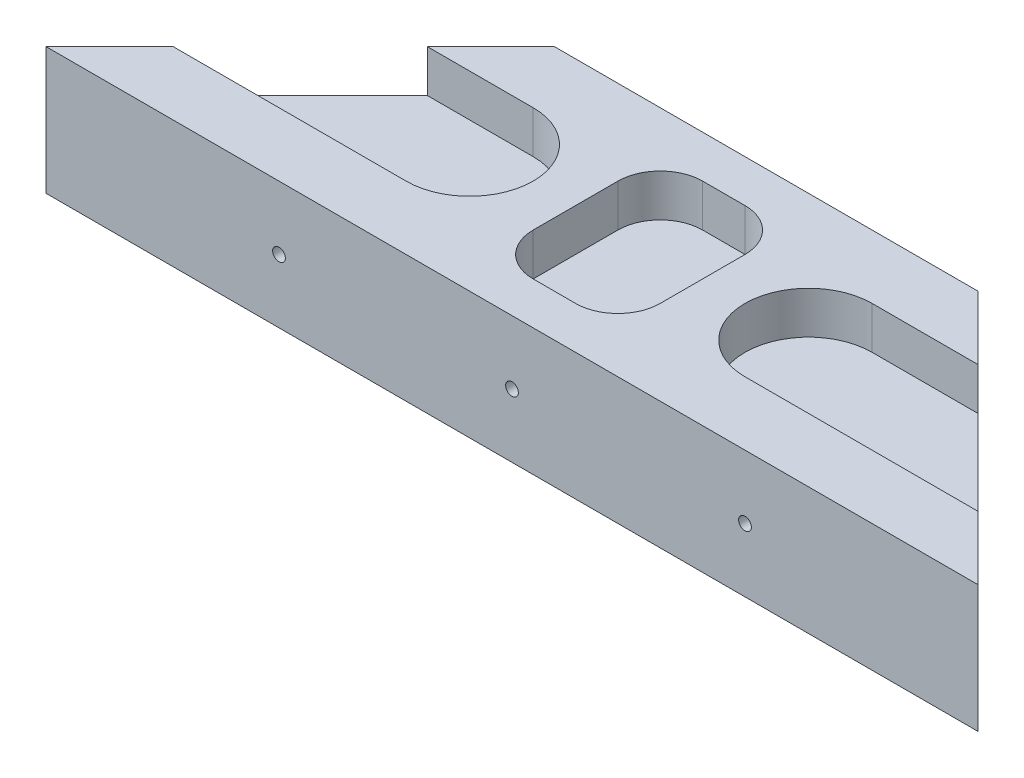
ISO-10303-21;
HEADER;
FILE_DESCRIPTION(('STEP AP214'),'2;1');
FILE_NAME('part.step','',(''),(''),'','','');
FILE_SCHEMA(('AUTOMOTIVE_DESIGN { 1 0 10303 214 1 1 1 1 }'));
ENDSEC;
DATA;
#1=APPLICATION_CONTEXT('core data for automotive mechanical design processes');
#2=APPLICATION_PROTOCOL_DEFINITION('international standard','automotive_design',2000,#1);
#3=PRODUCT_CONTEXT('',#1,'mechanical');
#4=PRODUCT('Part','Part','',(#3));
#5=PRODUCT_RELATED_PRODUCT_CATEGORY('part','',(#4));
#6=PRODUCT_DEFINITION_FORMATION('','',#4);
#7=PRODUCT_DEFINITION_CONTEXT('part definition',#1,'design');
#8=PRODUCT_DEFINITION('design','',#6,#7);
#9=PRODUCT_DEFINITION_SHAPE('','',#8);
#10=(LENGTH_UNIT() NAMED_UNIT(*) SI_UNIT(.MILLI.,.METRE.));
#11=(NAMED_UNIT(*) PLANE_ANGLE_UNIT() SI_UNIT($,.RADIAN.));
#12=(NAMED_UNIT(*) SI_UNIT($,.STERADIAN.) SOLID_ANGLE_UNIT());
#13=UNCERTAINTY_MEASURE_WITH_UNIT(LENGTH_MEASURE(1.E-05),#10,'distance_accuracy_value','');
#14=(GEOMETRIC_REPRESENTATION_CONTEXT(3) GLOBAL_UNCERTAINTY_ASSIGNED_CONTEXT((#13)) GLOBAL_UNIT_ASSIGNED_CONTEXT((#10,
#11,#12)) REPRESENTATION_CONTEXT('',''));
#15=CARTESIAN_POINT('',(0.,0.,0.));
#16=DIRECTION('',(0.,0.,1.));
#17=DIRECTION('',(1.,0.,0.));
#18=AXIS2_PLACEMENT_3D('',#15,#16,#17);
#19=CARTESIAN_POINT('',(30.0000000000003,15.,-30.));
#20=DIRECTION('',(0.707106781186544,0.,0.707106781186551));
#21=DIRECTION('',(0.707106781186551,0.,-0.707106781186544));
#22=AXIS2_PLACEMENT_3D('',#19,#20,#21);
#23=PLANE('',#22);
#24=CARTESIAN_POINT('',(27.5,7.5,-27.4999999999997));
#25=DIRECTION('',(0.707106781186544,0.,0.707106781186551));
#26=DIRECTION('',(-0.707106781186551,0.,0.707106781186544));
#27=AXIS2_PLACEMENT_3D('',#24,#25,#26);
#28=ELLIPSE('',#27,1.06066017177982,0.750000000000002);
#29=CARTESIAN_POINT('',(26.75,7.5,-26.7499999999997));
#30=VERTEX_POINT('',#29);
#31=EDGE_CURVE('E258',#30,#30,#28,.T.);
#32=ORIENTED_EDGE('',*,*,#31,.T.);
#33=EDGE_LOOP('',(#32));
#34=FACE_BOUND('',#33,.T.);
#35=DIRECTION('',(-0.707106781186551,0.,0.707106781186544));
#36=VECTOR('',#35,1.);
#37=CARTESIAN_POINT('',(30.0000000000003,10.,-30.));
#38=LINE('',#37,#36);
#39=CARTESIAN_POINT('',(22.5000000000002,10.,-22.5));
#40=VERTEX_POINT('',#39);
#41=CARTESIAN_POINT('',(7.50000000000008,10.,-7.5));
#42=VERTEX_POINT('',#41);
#43=EDGE_CURVE('E11',#40,#42,#38,.T.);
#44=ORIENTED_EDGE('',*,*,#43,.F.);
#45=DIRECTION('',(0.,1.,0.));
#46=VECTOR('',#45,1.);
#47=CARTESIAN_POINT('',(22.5000000000002,15.,-22.5));
#48=LINE('',#47,#46);
#49=CARTESIAN_POINT('',(22.5000000000002,15.,-22.5));
#50=VERTEX_POINT('',#49);
#51=EDGE_CURVE('E304',#40,#50,#48,.T.);
#52=ORIENTED_EDGE('',*,*,#51,.T.);
#53=DIRECTION('',(-0.707106781186551,0.,0.707106781186544));
#54=VECTOR('',#53,1.);
#55=CARTESIAN_POINT('',(30.0000000000003,15.,-30.));
#56=LINE('',#55,#54);
#57=CARTESIAN_POINT('',(30.0000000000003,15.,-30.));
#58=VERTEX_POINT('',#57);
#59=EDGE_CURVE('E308',#58,#50,#56,.T.);
#60=ORIENTED_EDGE('',*,*,#59,.F.);
#61=DIRECTION('',(0.,-1.,0.));
#62=VECTOR('',#61,1.);
#63=CARTESIAN_POINT('',(30.0000000000003,15.,-30.));
#64=LINE('',#63,#62);
#65=CARTESIAN_POINT('',(30.0000000000003,0.,-30.));
#66=VERTEX_POINT('',#65);
#67=EDGE_CURVE('E320',#58,#66,#64,.T.);
#68=ORIENTED_EDGE('',*,*,#67,.T.);
#69=DIRECTION('',(-0.707106781186551,0.,0.707106781186544));
#70=VECTOR('',#69,1.);
#71=CARTESIAN_POINT('',(30.0000000000003,0.,-30.));
#72=LINE('',#71,#70);
#73=CARTESIAN_POINT('',(0.,0.,0.));
#74=VERTEX_POINT('',#73);
#75=EDGE_CURVE('E307',#66,#74,#72,.T.);
#76=ORIENTED_EDGE('',*,*,#75,.T.);
#77=DIRECTION('',(0.,-1.,0.));
#78=VECTOR('',#77,1.);
#79=CARTESIAN_POINT('',(0.,15.,0.));
#80=LINE('',#79,#78);
#81=CARTESIAN_POINT('',(0.,15.,0.));
#82=VERTEX_POINT('',#81);
#83=EDGE_CURVE('E337',#82,#74,#80,.T.);
#84=ORIENTED_EDGE('',*,*,#83,.F.);
#85=CARTESIAN_POINT('',(7.50000000000008,15.,-7.5));
#86=VERTEX_POINT('',#85);
#87=EDGE_CURVE('E312',#86,#82,#56,.T.);
#88=ORIENTED_EDGE('',*,*,#87,.F.);
#89=DIRECTION('',(0.,-1.,0.));
#90=VECTOR('',#89,1.);
#91=CARTESIAN_POINT('',(7.50000000000008,15.,-7.5));
#92=LINE('',#91,#90);
#93=EDGE_CURVE('E301',#86,#42,#92,.T.);
#94=ORIENTED_EDGE('',*,*,#93,.T.);
#95=EDGE_LOOP('',(#44,#52,#60,#68,#76,#84,#88,#94));
#96=FACE_BOUND('',#95,.T.);
#97=ADVANCED_FACE('F39',(#34,#96),#23,.F.);
#98=CARTESIAN_POINT('',(0.,15.,0.));
#99=DIRECTION('',(0.,0.,-1.));
#100=DIRECTION('',(-1.,0.,0.));
#101=AXIS2_PLACEMENT_3D('',#98,#99,#100);
#102=PLANE('',#101);
#103=CARTESIAN_POINT('',(27.5,7.5,0.));
#104=DIRECTION('',(0.,0.,1.));
#105=DIRECTION('',(1.,0.,0.));
#106=AXIS2_PLACEMENT_3D('',#103,#104,#105);
#107=CIRCLE('',#106,0.750000000000002);
#108=CARTESIAN_POINT('',(28.25,7.5,0.));
#109=VERTEX_POINT('',#108);
#110=EDGE_CURVE('E247',#109,#109,#107,.T.);
#111=ORIENTED_EDGE('',*,*,#110,.F.);
#112=EDGE_LOOP('',(#111));
#113=FACE_BOUND('',#112,.T.);
#114=CARTESIAN_POINT('',(55.,7.5,0.));
#115=DIRECTION('',(0.,0.,1.));
#116=DIRECTION('',(1.,0.,0.));
#117=AXIS2_PLACEMENT_3D('',#114,#115,#116);
#118=CIRCLE('',#117,0.749999999999999);
#119=CARTESIAN_POINT('',(55.75,7.5,0.));
#120=VERTEX_POINT('',#119);
#121=EDGE_CURVE('E250',#120,#120,#118,.T.);
#122=ORIENTED_EDGE('',*,*,#121,.F.);
#123=EDGE_LOOP('',(#122));
#124=FACE_BOUND('',#123,.T.);
#125=CARTESIAN_POINT('',(82.5,7.5,0.));
#126=DIRECTION('',(0.,0.,1.));
#127=DIRECTION('',(1.,0.,0.));
#128=AXIS2_PLACEMENT_3D('',#125,#126,#127);
#129=CIRCLE('',#128,0.749999999999999);
#130=CARTESIAN_POINT('',(83.25,7.5,0.));
#131=VERTEX_POINT('',#130);
#132=EDGE_CURVE('E235',#131,#131,#129,.T.);
#133=ORIENTED_EDGE('',*,*,#132,.F.);
#134=EDGE_LOOP('',(#133));
#135=FACE_BOUND('',#134,.T.);
#136=DIRECTION('',(1.,0.,0.));
#137=VECTOR('',#136,1.);
#138=CARTESIAN_POINT('',(0.,0.,0.));
#139=LINE('',#138,#137);
#140=CARTESIAN_POINT('',(110.,0.,0.));
#141=VERTEX_POINT('',#140);
#142=EDGE_CURVE('E323',#74,#141,#139,.T.);
#143=ORIENTED_EDGE('',*,*,#142,.T.);
#144=DIRECTION('',(0.,-1.,0.));
#145=VECTOR('',#144,1.);
#146=CARTESIAN_POINT('',(110.,15.,0.));
#147=LINE('',#146,#145);
#148=CARTESIAN_POINT('',(110.,15.,0.));
#149=VERTEX_POINT('',#148);
#150=EDGE_CURVE('E334',#149,#141,#147,.T.);
#151=ORIENTED_EDGE('',*,*,#150,.F.);
#152=DIRECTION('',(1.,0.,0.));
#153=VECTOR('',#152,1.);
#154=CARTESIAN_POINT('',(0.,15.,0.));
#155=LINE('',#154,#153);
#156=EDGE_CURVE('E311',#82,#149,#155,.T.);
#157=ORIENTED_EDGE('',*,*,#156,.F.);
#158=ORIENTED_EDGE('',*,*,#83,.T.);
#159=EDGE_LOOP('',(#143,#151,#157,#158));
#160=FACE_BOUND('',#159,.T.);
#161=ADVANCED_FACE('F394',(#113,#124,#135,#160),#102,.F.);
#162=CARTESIAN_POINT('',(110.,15.,0.));
#163=DIRECTION('',(-0.707106781186544,0.,0.707106781186551));
#164=DIRECTION('',(0.707106781186551,0.,0.707106781186544));
#165=AXIS2_PLACEMENT_3D('',#162,#163,#164);
#166=PLANE('',#165);
#167=CARTESIAN_POINT('',(82.5,7.5,-27.4999999999997));
#168=DIRECTION('',(-0.707106781186544,0.,0.707106781186551));
#169=DIRECTION('',(0.707106781186551,0.,0.707106781186544));
#170=AXIS2_PLACEMENT_3D('',#167,#168,#169);
#171=ELLIPSE('',#170,1.06066017177981,0.749999999999999);
#172=CARTESIAN_POINT('',(83.25,7.5,-26.7499999999997));
#173=VERTEX_POINT('',#172);
#174=EDGE_CURVE('E42',#173,#173,#171,.T.);
#175=ORIENTED_EDGE('',*,*,#174,.T.);
#176=EDGE_LOOP('',(#175));
#177=FACE_BOUND('',#176,.T.);
#178=DIRECTION('',(0.707106781186551,0.,0.707106781186544));
#179=VECTOR('',#178,1.);
#180=CARTESIAN_POINT('',(110.,10.,0.));
#181=LINE('',#180,#179);
#182=CARTESIAN_POINT('',(87.4999999999997,10.,-22.5));
#183=VERTEX_POINT('',#182);
#184=CARTESIAN_POINT('',(102.5,10.,-7.50000000000002));
#185=VERTEX_POINT('',#184);
#186=EDGE_CURVE('E47',#183,#185,#181,.T.);
#187=ORIENTED_EDGE('',*,*,#186,.T.);
#188=DIRECTION('',(0.,1.,0.));
#189=VECTOR('',#188,1.);
#190=CARTESIAN_POINT('',(102.5,15.,-7.50000000000002));
#191=LINE('',#190,#189);
#192=CARTESIAN_POINT('',(102.5,15.,-7.50000000000002));
#193=VERTEX_POINT('',#192);
#194=EDGE_CURVE('E298',#185,#193,#191,.T.);
#195=ORIENTED_EDGE('',*,*,#194,.T.);
#196=DIRECTION('',(-0.707106781186551,0.,-0.707106781186544));
#197=VECTOR('',#196,1.);
#198=CARTESIAN_POINT('',(110.,15.,0.));
#199=LINE('',#198,#197);
#200=EDGE_CURVE('E315',#149,#193,#199,.T.);
#201=ORIENTED_EDGE('',*,*,#200,.F.);
#202=ORIENTED_EDGE('',*,*,#150,.T.);
#203=DIRECTION('',(-0.707106781186551,0.,-0.707106781186544));
#204=VECTOR('',#203,1.);
#205=CARTESIAN_POINT('',(110.,0.,0.));
#206=LINE('',#205,#204);
#207=CARTESIAN_POINT('',(79.9999999999997,0.,-30.));
#208=VERTEX_POINT('',#207);
#209=EDGE_CURVE('E325',#141,#208,#206,.T.);
#210=ORIENTED_EDGE('',*,*,#209,.T.);
#211=DIRECTION('',(0.,-1.,0.));
#212=VECTOR('',#211,1.);
#213=CARTESIAN_POINT('',(79.9999999999997,15.,-30.));
#214=LINE('',#213,#212);
#215=CARTESIAN_POINT('',(79.9999999999997,15.,-30.));
#216=VERTEX_POINT('',#215);
#217=EDGE_CURVE('E331',#216,#208,#214,.T.);
#218=ORIENTED_EDGE('',*,*,#217,.F.);
#219=CARTESIAN_POINT('',(87.4999999999997,15.,-22.5));
#220=VERTEX_POINT('',#219);
#221=EDGE_CURVE('E314',#220,#216,#199,.T.);
#222=ORIENTED_EDGE('',*,*,#221,.F.);
#223=DIRECTION('',(0.,-1.,0.));
#224=VECTOR('',#223,1.);
#225=CARTESIAN_POINT('',(87.4999999999997,15.,-22.5));
#226=LINE('',#225,#224);
#227=EDGE_CURVE('E62',#220,#183,#226,.T.);
#228=ORIENTED_EDGE('',*,*,#227,.T.);
#229=EDGE_LOOP('',(#187,#195,#201,#202,#210,#218,#222,#228));
#230=FACE_BOUND('',#229,.T.);
#231=ADVANCED_FACE('F347',(#177,#230),#166,.F.);
#232=CARTESIAN_POINT('',(79.9999999999997,15.,-30.));
#233=DIRECTION('',(0.,0.,1.));
#234=DIRECTION('',(1.,0.,0.));
#235=AXIS2_PLACEMENT_3D('',#232,#233,#234);
#236=PLANE('',#235);
#237=CARTESIAN_POINT('',(55.,7.5,-30.));
#238=DIRECTION('',(0.,0.,1.));
#239=DIRECTION('',(1.,0.,0.));
#240=AXIS2_PLACEMENT_3D('',#237,#238,#239);
#241=CIRCLE('',#240,0.749999999999999);
#242=CARTESIAN_POINT('',(55.75,7.5,-30.));
#243=VERTEX_POINT('',#242);
#244=EDGE_CURVE('E251',#243,#243,#241,.F.);
#245=ORIENTED_EDGE('',*,*,#244,.F.);
#246=EDGE_LOOP('',(#245));
#247=FACE_BOUND('',#246,.T.);
#248=DIRECTION('',(-1.,0.,0.));
#249=VECTOR('',#248,1.);
#250=CARTESIAN_POINT('',(79.9999999999997,0.,-30.));
#251=LINE('',#250,#249);
#252=EDGE_CURVE('E327',#208,#66,#251,.T.);
#253=ORIENTED_EDGE('',*,*,#252,.T.);
#254=ORIENTED_EDGE('',*,*,#67,.F.);
#255=DIRECTION('',(-1.,0.,0.));
#256=VECTOR('',#255,1.);
#257=CARTESIAN_POINT('',(79.9999999999997,15.,-30.));
#258=LINE('',#257,#256);
#259=EDGE_CURVE('E318',#216,#58,#258,.T.);
#260=ORIENTED_EDGE('',*,*,#259,.F.);
#261=ORIENTED_EDGE('',*,*,#217,.T.);
#262=EDGE_LOOP('',(#253,#254,#260,#261));
#263=FACE_BOUND('',#262,.T.);
#264=ADVANCED_FACE('F375',(#247,#263),#236,.F.);
#265=CARTESIAN_POINT('',(0.,15.,0.));
#266=DIRECTION('',(0.,-1.,0.));
#267=DIRECTION('',(0.,0.,-1.));
#268=AXIS2_PLACEMENT_3D('',#265,#266,#267);
#269=PLANE('',#268);
#270=DIRECTION('',(1.,0.,0.));
#271=VECTOR('',#270,1.);
#272=CARTESIAN_POINT('',(52.5000000000002,15.,-5.));
#273=LINE('',#272,#271);
#274=CARTESIAN_POINT('',(52.5000000000002,15.,-5.));
#275=VERTEX_POINT('',#274);
#276=CARTESIAN_POINT('',(57.4999999999998,15.,-5.));
#277=VERTEX_POINT('',#276);
#278=EDGE_CURVE('E217',#275,#277,#273,.T.);
#279=ORIENTED_EDGE('',*,*,#278,.F.);
#280=CARTESIAN_POINT('',(52.5000000000001,15.,-10.));
#281=DIRECTION('',(0.,1.,0.));
#282=DIRECTION('',(0.,0.,1.));
#283=AXIS2_PLACEMENT_3D('',#280,#281,#282);
#284=CIRCLE('',#283,5.);
#285=CARTESIAN_POINT('',(47.5000000000002,15.,-10.));
#286=VERTEX_POINT('',#285);
#287=EDGE_CURVE('E54',#286,#275,#284,.T.);
#288=ORIENTED_EDGE('',*,*,#287,.F.);
#289=DIRECTION('',(0.,0.,1.));
#290=VECTOR('',#289,1.);
#291=CARTESIAN_POINT('',(47.5000000000002,15.,-20.));
#292=LINE('',#291,#290);
#293=CARTESIAN_POINT('',(47.5000000000002,15.,-20.));
#294=VERTEX_POINT('',#293);
#295=EDGE_CURVE('E197',#294,#286,#292,.T.);
#296=ORIENTED_EDGE('',*,*,#295,.F.);
#297=CARTESIAN_POINT('',(52.5000000000001,15.,-20.));
#298=DIRECTION('',(0.,1.,0.));
#299=DIRECTION('',(0.,0.,1.));
#300=AXIS2_PLACEMENT_3D('',#297,#298,#299);
#301=CIRCLE('',#300,5.);
#302=CARTESIAN_POINT('',(52.5000000000002,15.,-25.));
#303=VERTEX_POINT('',#302);
#304=EDGE_CURVE('E200',#303,#294,#301,.T.);
#305=ORIENTED_EDGE('',*,*,#304,.F.);
#306=DIRECTION('',(-1.,0.,0.));
#307=VECTOR('',#306,1.);
#308=CARTESIAN_POINT('',(52.5000000000002,15.,-25.));
#309=LINE('',#308,#307);
#310=CARTESIAN_POINT('',(57.4999999999998,15.,-25.));
#311=VERTEX_POINT('',#310);
#312=EDGE_CURVE('E228',#311,#303,#309,.T.);
#313=ORIENTED_EDGE('',*,*,#312,.F.);
#314=CARTESIAN_POINT('',(57.4999999999999,15.,-20.));
#315=DIRECTION('',(0.,1.,0.));
#316=DIRECTION('',(0.,0.,-1.));
#317=AXIS2_PLACEMENT_3D('',#314,#315,#316);
#318=CIRCLE('',#317,5.);
#319=CARTESIAN_POINT('',(62.4999999999999,15.,-20.));
#320=VERTEX_POINT('',#319);
#321=EDGE_CURVE('E225',#320,#311,#318,.T.);
#322=ORIENTED_EDGE('',*,*,#321,.F.);
#323=DIRECTION('',(0.,0.,-1.));
#324=VECTOR('',#323,1.);
#325=CARTESIAN_POINT('',(62.4999999999999,15.,-20.));
#326=LINE('',#325,#324);
#327=CARTESIAN_POINT('',(62.4999999999999,15.,-10.));
#328=VERTEX_POINT('',#327);
#329=EDGE_CURVE('E222',#328,#320,#326,.T.);
#330=ORIENTED_EDGE('',*,*,#329,.F.);
#331=CARTESIAN_POINT('',(57.4999999999999,15.,-10.));
#332=DIRECTION('',(0.,1.,0.));
#333=DIRECTION('',(0.,0.,1.));
#334=AXIS2_PLACEMENT_3D('',#331,#332,#333);
#335=CIRCLE('',#334,5.);
#336=EDGE_CURVE('E219',#277,#328,#335,.T.);
#337=ORIENTED_EDGE('',*,*,#336,.F.);
#338=EDGE_LOOP('',(#279,#288,#296,#305,#313,#322,#330,#337));
#339=FACE_BOUND('',#338,.T.);
#340=ORIENTED_EDGE('',*,*,#59,.T.);
#341=DIRECTION('',(-1.,0.,0.));
#342=VECTOR('',#341,1.);
#343=CARTESIAN_POINT('',(-4.99999999999985,15.,-22.5));
#344=LINE('',#343,#342);
#345=CARTESIAN_POINT('',(35.0000000000001,15.,-22.5));
#346=VERTEX_POINT('',#345);
#347=EDGE_CURVE('E265',#346,#50,#344,.T.);
#348=ORIENTED_EDGE('',*,*,#347,.F.);
#349=CARTESIAN_POINT('',(35.0000000000001,15.,-15.));
#350=DIRECTION('',(0.,1.,0.));
#351=DIRECTION('',(0.,0.,1.));
#352=AXIS2_PLACEMENT_3D('',#349,#350,#351);
#353=CIRCLE('',#352,7.5);
#354=CARTESIAN_POINT('',(35.0000000000001,15.,-7.50000000000001));
#355=VERTEX_POINT('',#354);
#356=EDGE_CURVE('E272',#355,#346,#353,.T.);
#357=ORIENTED_EDGE('',*,*,#356,.F.);
#358=DIRECTION('',(-1.,0.,0.));
#359=VECTOR('',#358,1.);
#360=CARTESIAN_POINT('',(0.,15.,-7.5));
#361=LINE('',#360,#359);
#362=EDGE_CURVE('E342',#355,#86,#361,.T.);
#363=ORIENTED_EDGE('',*,*,#362,.T.);
#364=ORIENTED_EDGE('',*,*,#87,.T.);
#365=ORIENTED_EDGE('',*,*,#156,.T.);
#366=ORIENTED_EDGE('',*,*,#200,.T.);
#367=DIRECTION('',(1.,0.,0.));
#368=VECTOR('',#367,1.);
#369=CARTESIAN_POINT('',(115.,15.,-7.50000000000003));
#370=LINE('',#369,#368);
#371=CARTESIAN_POINT('',(74.9999999999998,15.,-7.50000000000002));
#372=VERTEX_POINT('',#371);
#373=EDGE_CURVE('E286',#372,#193,#370,.T.);
#374=ORIENTED_EDGE('',*,*,#373,.F.);
#375=CARTESIAN_POINT('',(74.9999999999998,15.,-15.));
#376=DIRECTION('',(0.,1.,0.));
#377=DIRECTION('',(0.,0.,-1.));
#378=AXIS2_PLACEMENT_3D('',#375,#376,#377);
#379=CIRCLE('',#378,7.5);
#380=CARTESIAN_POINT('',(74.9999999999998,15.,-22.5));
#381=VERTEX_POINT('',#380);
#382=EDGE_CURVE('E275',#381,#372,#379,.T.);
#383=ORIENTED_EDGE('',*,*,#382,.F.);
#384=DIRECTION('',(1.,0.,0.));
#385=VECTOR('',#384,1.);
#386=CARTESIAN_POINT('',(0.,15.,-22.5));
#387=LINE('',#386,#385);
#388=EDGE_CURVE('E340',#381,#220,#387,.T.);
#389=ORIENTED_EDGE('',*,*,#388,.T.);
#390=ORIENTED_EDGE('',*,*,#221,.T.);
#391=ORIENTED_EDGE('',*,*,#259,.T.);
#392=EDGE_LOOP('',(#340,#348,#357,#363,#364,#365,#366,#374,#383,#389,#390,#391));
#393=FACE_BOUND('',#392,.T.);
#394=ADVANCED_FACE('F363',(#339,#393),#269,.F.);
#395=CARTESIAN_POINT('',(0.,0.,0.));
#396=DIRECTION('',(0.,-1.,0.));
#397=DIRECTION('',(0.,0.,-1.));
#398=AXIS2_PLACEMENT_3D('',#395,#396,#397);
#399=PLANE('',#398);
#400=ORIENTED_EDGE('',*,*,#75,.F.);
#401=ORIENTED_EDGE('',*,*,#252,.F.);
#402=ORIENTED_EDGE('',*,*,#209,.F.);
#403=ORIENTED_EDGE('',*,*,#142,.F.);
#404=EDGE_LOOP('',(#400,#401,#402,#403));
#405=FACE_BOUND('',#404,.T.);
#406=ADVANCED_FACE('F372',(#405),#399,.T.);
#407=CARTESIAN_POINT('',(115.,10.,-15.));
#408=DIRECTION('',(0.,-1.,0.));
#409=DIRECTION('',(0.,0.,-1.));
#410=AXIS2_PLACEMENT_3D('',#407,#408,#409);
#411=PLANE('',#410);
#412=DIRECTION('',(-1.,0.,0.));
#413=VECTOR('',#412,1.);
#414=CARTESIAN_POINT('',(115.,10.,-22.5));
#415=LINE('',#414,#413);
#416=CARTESIAN_POINT('',(74.9999999999998,10.,-22.5));
#417=VERTEX_POINT('',#416);
#418=EDGE_CURVE('E288',#183,#417,#415,.T.);
#419=ORIENTED_EDGE('',*,*,#418,.T.);
#420=CARTESIAN_POINT('',(74.9999999999998,10.,-15.));
#421=DIRECTION('',(0.,1.,0.));
#422=DIRECTION('',(0.,0.,-1.));
#423=AXIS2_PLACEMENT_3D('',#420,#421,#422);
#424=CIRCLE('',#423,7.5);
#425=CARTESIAN_POINT('',(74.9999999999998,10.,-7.50000000000002));
#426=VERTEX_POINT('',#425);
#427=EDGE_CURVE('E293',#417,#426,#424,.T.);
#428=ORIENTED_EDGE('',*,*,#427,.T.);
#429=DIRECTION('',(1.,0.,0.));
#430=VECTOR('',#429,1.);
#431=CARTESIAN_POINT('',(115.,10.,-7.50000000000003));
#432=LINE('',#431,#430);
#433=EDGE_CURVE('E284',#426,#185,#432,.T.);
#434=ORIENTED_EDGE('',*,*,#433,.T.);
#435=ORIENTED_EDGE('',*,*,#186,.F.);
#436=EDGE_LOOP('',(#419,#428,#434,#435));
#437=FACE_BOUND('',#436,.T.);
#438=ADVANCED_FACE('F351',(#437),#411,.F.);
#439=CARTESIAN_POINT('',(115.,10.,-7.50000000000003));
#440=DIRECTION('',(0.,0.,1.));
#441=DIRECTION('',(1.,0.,0.));
#442=AXIS2_PLACEMENT_3D('',#439,#440,#441);
#443=PLANE('',#442);
#444=ORIENTED_EDGE('',*,*,#433,.F.);
#445=DIRECTION('',(0.,1.,0.));
#446=VECTOR('',#445,1.);
#447=CARTESIAN_POINT('',(74.9999999999998,10.,-7.50000000000002));
#448=LINE('',#447,#446);
#449=EDGE_CURVE('E261',#426,#372,#448,.T.);
#450=ORIENTED_EDGE('',*,*,#449,.T.);
#451=ORIENTED_EDGE('',*,*,#373,.T.);
#452=ORIENTED_EDGE('',*,*,#194,.F.);
#453=EDGE_LOOP('',(#444,#450,#451,#452));
#454=FACE_BOUND('',#453,.T.);
#455=ADVANCED_FACE('F360',(#454),#443,.F.);
#456=CARTESIAN_POINT('',(115.,10.,-22.5));
#457=DIRECTION('',(0.,0.,-1.));
#458=DIRECTION('',(-1.,0.,0.));
#459=AXIS2_PLACEMENT_3D('',#456,#457,#458);
#460=PLANE('',#459);
#461=ORIENTED_EDGE('',*,*,#388,.F.);
#462=DIRECTION('',(0.,1.,0.));
#463=VECTOR('',#462,1.);
#464=CARTESIAN_POINT('',(74.9999999999998,10.,-22.5));
#465=LINE('',#464,#463);
#466=EDGE_CURVE('E281',#417,#381,#465,.T.);
#467=ORIENTED_EDGE('',*,*,#466,.F.);
#468=ORIENTED_EDGE('',*,*,#418,.F.);
#469=ORIENTED_EDGE('',*,*,#227,.F.);
#470=EDGE_LOOP('',(#461,#467,#468,#469));
#471=FACE_BOUND('',#470,.T.);
#472=ADVANCED_FACE('F354',(#471),#460,.F.);
#473=CARTESIAN_POINT('',(74.9999999999998,10.,-15.));
#474=DIRECTION('',(0.,1.,0.));
#475=DIRECTION('',(0.,0.,1.));
#476=AXIS2_PLACEMENT_3D('',#473,#474,#475);
#477=CYLINDRICAL_SURFACE('',#476,7.5);
#478=ORIENTED_EDGE('',*,*,#382,.T.);
#479=ORIENTED_EDGE('',*,*,#449,.F.);
#480=ORIENTED_EDGE('',*,*,#427,.F.);
#481=ORIENTED_EDGE('',*,*,#466,.T.);
#482=EDGE_LOOP('',(#478,#479,#480,#481));
#483=FACE_BOUND('',#482,.T.);
#484=ADVANCED_FACE('F358',(#483),#477,.F.);
#485=CARTESIAN_POINT('',(-4.99999999999985,10.,-15.));
#486=DIRECTION('',(0.,1.,0.));
#487=DIRECTION('',(0.,0.,1.));
#488=AXIS2_PLACEMENT_3D('',#485,#486,#487);
#489=PLANE('',#488);
#490=ORIENTED_EDGE('',*,*,#43,.T.);
#491=DIRECTION('',(1.,0.,0.));
#492=VECTOR('',#491,1.);
#493=CARTESIAN_POINT('',(-4.99999999999985,10.,-7.5));
#494=LINE('',#493,#492);
#495=CARTESIAN_POINT('',(35.0000000000001,10.,-7.50000000000001));
#496=VERTEX_POINT('',#495);
#497=EDGE_CURVE('E262',#42,#496,#494,.T.);
#498=ORIENTED_EDGE('',*,*,#497,.T.);
#499=CARTESIAN_POINT('',(35.0000000000001,10.,-15.));
#500=DIRECTION('',(0.,1.,0.));
#501=DIRECTION('',(0.,0.,1.));
#502=AXIS2_PLACEMENT_3D('',#499,#500,#501);
#503=CIRCLE('',#502,7.5);
#504=CARTESIAN_POINT('',(35.0000000000001,10.,-22.5));
#505=VERTEX_POINT('',#504);
#506=EDGE_CURVE('E264',#496,#505,#503,.T.);
#507=ORIENTED_EDGE('',*,*,#506,.T.);
#508=DIRECTION('',(-1.,0.,0.));
#509=VECTOR('',#508,1.);
#510=CARTESIAN_POINT('',(-4.99999999999985,10.,-22.5));
#511=LINE('',#510,#509);
#512=EDGE_CURVE('E268',#505,#40,#511,.T.);
#513=ORIENTED_EDGE('',*,*,#512,.T.);
#514=EDGE_LOOP('',(#490,#498,#507,#513));
#515=FACE_BOUND('',#514,.T.);
#516=ADVANCED_FACE('F421',(#515),#489,.T.);
#517=CARTESIAN_POINT('',(-4.99999999999985,10.,-22.5));
#518=DIRECTION('',(0.,0.,-1.));
#519=DIRECTION('',(-1.,0.,0.));
#520=AXIS2_PLACEMENT_3D('',#517,#518,#519);
#521=PLANE('',#520);
#522=ORIENTED_EDGE('',*,*,#512,.F.);
#523=DIRECTION('',(0.,1.,0.));
#524=VECTOR('',#523,1.);
#525=CARTESIAN_POINT('',(35.0000000000001,10.,-22.5));
#526=LINE('',#525,#524);
#527=EDGE_CURVE('E277',#505,#346,#526,.T.);
#528=ORIENTED_EDGE('',*,*,#527,.T.);
#529=ORIENTED_EDGE('',*,*,#347,.T.);
#530=ORIENTED_EDGE('',*,*,#51,.F.);
#531=EDGE_LOOP('',(#522,#528,#529,#530));
#532=FACE_BOUND('',#531,.T.);
#533=ADVANCED_FACE('F385',(#532),#521,.F.);
#534=CARTESIAN_POINT('',(-4.99999999999985,10.,-7.5));
#535=DIRECTION('',(0.,0.,1.));
#536=DIRECTION('',(1.,0.,0.));
#537=AXIS2_PLACEMENT_3D('',#534,#535,#536);
#538=PLANE('',#537);
#539=ORIENTED_EDGE('',*,*,#362,.F.);
#540=DIRECTION('',(0.,1.,0.));
#541=VECTOR('',#540,1.);
#542=CARTESIAN_POINT('',(35.0000000000001,10.,-7.50000000000001));
#543=LINE('',#542,#541);
#544=EDGE_CURVE('E271',#496,#355,#543,.T.);
#545=ORIENTED_EDGE('',*,*,#544,.F.);
#546=ORIENTED_EDGE('',*,*,#497,.F.);
#547=ORIENTED_EDGE('',*,*,#93,.F.);
#548=EDGE_LOOP('',(#539,#545,#546,#547));
#549=FACE_BOUND('',#548,.T.);
#550=ADVANCED_FACE('F392',(#549),#538,.F.);
#551=CARTESIAN_POINT('',(35.0000000000001,10.,-15.));
#552=DIRECTION('',(0.,1.,0.));
#553=DIRECTION('',(0.,0.,1.));
#554=AXIS2_PLACEMENT_3D('',#551,#552,#553);
#555=CYLINDRICAL_SURFACE('',#554,7.5);
#556=ORIENTED_EDGE('',*,*,#356,.T.);
#557=ORIENTED_EDGE('',*,*,#527,.F.);
#558=ORIENTED_EDGE('',*,*,#506,.F.);
#559=ORIENTED_EDGE('',*,*,#544,.T.);
#560=EDGE_LOOP('',(#556,#557,#558,#559));
#561=FACE_BOUND('',#560,.T.);
#562=ADVANCED_FACE('F388',(#561),#555,.F.);
#563=CARTESIAN_POINT('',(55.,7.5,-32.1213203435596));
#564=DIRECTION('',(0.,0.,1.));
#565=DIRECTION('',(1.,0.,0.));
#566=AXIS2_PLACEMENT_3D('',#563,#564,#565);
#567=CYLINDRICAL_SURFACE('',#566,0.749999999999999);
#568=ORIENTED_EDGE('',*,*,#244,.T.);
#569=EDGE_LOOP('',(#568));
#570=FACE_BOUND('',#569,.T.);
#571=ORIENTED_EDGE('',*,*,#121,.T.);
#572=EDGE_LOOP('',(#571));
#573=FACE_BOUND('',#572,.T.);
#574=ADVANCED_FACE('F428',(#570,#573),#567,.F.);
#575=CARTESIAN_POINT('',(82.5,7.5,-32.1213203435596));
#576=DIRECTION('',(0.,0.,1.));
#577=DIRECTION('',(1.,0.,0.));
#578=AXIS2_PLACEMENT_3D('',#575,#576,#577);
#579=CYLINDRICAL_SURFACE('',#578,0.749999999999999);
#580=ORIENTED_EDGE('',*,*,#132,.T.);
#581=EDGE_LOOP('',(#580));
#582=FACE_BOUND('',#581,.T.);
#583=ORIENTED_EDGE('',*,*,#174,.F.);
#584=EDGE_LOOP('',(#583));
#585=FACE_BOUND('',#584,.T.);
#586=ADVANCED_FACE('F434',(#582,#585),#579,.F.);
#587=CARTESIAN_POINT('',(27.5,7.5,-32.1213203435596));
#588=DIRECTION('',(0.,0.,1.));
#589=DIRECTION('',(1.,0.,0.));
#590=AXIS2_PLACEMENT_3D('',#587,#588,#589);
#591=CYLINDRICAL_SURFACE('',#590,0.750000000000002);
#592=ORIENTED_EDGE('',*,*,#110,.T.);
#593=EDGE_LOOP('',(#592));
#594=FACE_BOUND('',#593,.T.);
#595=ORIENTED_EDGE('',*,*,#31,.F.);
#596=EDGE_LOOP('',(#595));
#597=FACE_BOUND('',#596,.T.);
#598=ADVANCED_FACE('F437',(#594,#597),#591,.F.);
#599=CARTESIAN_POINT('',(52.5000000000001,10.,-10.));
#600=DIRECTION('',(0.,1.,0.));
#601=DIRECTION('',(0.,0.,1.));
#602=AXIS2_PLACEMENT_3D('',#599,#600,#601);
#603=CYLINDRICAL_SURFACE('',#602,5.);
#604=ORIENTED_EDGE('',*,*,#287,.T.);
#605=DIRECTION('',(0.,1.,0.));
#606=VECTOR('',#605,1.);
#607=CARTESIAN_POINT('',(52.5000000000002,10.,-5.));
#608=LINE('',#607,#606);
#609=CARTESIAN_POINT('',(52.5000000000002,10.,-5.));
#610=VERTEX_POINT('',#609);
#611=EDGE_CURVE('E174',#610,#275,#608,.T.);
#612=ORIENTED_EDGE('',*,*,#611,.F.);
#613=CARTESIAN_POINT('',(52.5000000000001,10.,-10.));
#614=DIRECTION('',(0.,1.,0.));
#615=DIRECTION('',(0.,0.,1.));
#616=AXIS2_PLACEMENT_3D('',#613,#614,#615);
#617=CIRCLE('',#616,5.);
#618=CARTESIAN_POINT('',(47.5000000000002,10.,-10.));
#619=VERTEX_POINT('',#618);
#620=EDGE_CURVE('E178',#619,#610,#617,.T.);
#621=ORIENTED_EDGE('',*,*,#620,.F.);
#622=DIRECTION('',(0.,1.,0.));
#623=VECTOR('',#622,1.);
#624=CARTESIAN_POINT('',(47.5000000000002,10.,-10.));
#625=LINE('',#624,#623);
#626=EDGE_CURVE('E233',#619,#286,#625,.T.);
#627=ORIENTED_EDGE('',*,*,#626,.T.);
#628=EDGE_LOOP('',(#604,#612,#621,#627));
#629=FACE_BOUND('',#628,.T.);
#630=ADVANCED_FACE('F176',(#629),#603,.F.);
#631=CARTESIAN_POINT('',(47.5000000000002,10.,-20.));
#632=DIRECTION('',(-1.,0.,0.));
#633=DIRECTION('',(0.,0.,1.));
#634=AXIS2_PLACEMENT_3D('',#631,#632,#633);
#635=PLANE('',#634);
#636=ORIENTED_EDGE('',*,*,#295,.T.);
#637=ORIENTED_EDGE('',*,*,#626,.F.);
#638=DIRECTION('',(0.,0.,1.));
#639=VECTOR('',#638,1.);
#640=CARTESIAN_POINT('',(47.5000000000002,10.,-20.));
#641=LINE('',#640,#639);
#642=CARTESIAN_POINT('',(47.5000000000002,10.,-20.));
#643=VERTEX_POINT('',#642);
#644=EDGE_CURVE('E184',#643,#619,#641,.T.);
#645=ORIENTED_EDGE('',*,*,#644,.F.);
#646=DIRECTION('',(0.,1.,0.));
#647=VECTOR('',#646,1.);
#648=CARTESIAN_POINT('',(47.5000000000002,10.,-20.));
#649=LINE('',#648,#647);
#650=EDGE_CURVE('E236',#643,#294,#649,.T.);
#651=ORIENTED_EDGE('',*,*,#650,.T.);
#652=EDGE_LOOP('',(#636,#637,#645,#651));
#653=FACE_BOUND('',#652,.T.);
#654=ADVANCED_FACE('F447',(#653),#635,.F.);
#655=CARTESIAN_POINT('',(52.5000000000001,10.,-20.));
#656=DIRECTION('',(0.,1.,0.));
#657=DIRECTION('',(0.,0.,1.));
#658=AXIS2_PLACEMENT_3D('',#655,#656,#657);
#659=CYLINDRICAL_SURFACE('',#658,5.);
#660=ORIENTED_EDGE('',*,*,#304,.T.);
#661=ORIENTED_EDGE('',*,*,#650,.F.);
#662=CARTESIAN_POINT('',(52.5000000000001,10.,-20.));
#663=DIRECTION('',(0.,1.,0.));
#664=DIRECTION('',(0.,0.,1.));
#665=AXIS2_PLACEMENT_3D('',#662,#663,#664);
#666=CIRCLE('',#665,5.);
#667=CARTESIAN_POINT('',(52.5000000000002,10.,-25.));
#668=VERTEX_POINT('',#667);
#669=EDGE_CURVE('E213',#668,#643,#666,.T.);
#670=ORIENTED_EDGE('',*,*,#669,.F.);
#671=DIRECTION('',(0.,1.,0.));
#672=VECTOR('',#671,1.);
#673=CARTESIAN_POINT('',(52.5000000000002,10.,-25.));
#674=LINE('',#673,#672);
#675=EDGE_CURVE('E238',#668,#303,#674,.T.);
#676=ORIENTED_EDGE('',*,*,#675,.T.);
#677=EDGE_LOOP('',(#660,#661,#670,#676));
#678=FACE_BOUND('',#677,.T.);
#679=ADVANCED_FACE('F465',(#678),#659,.F.);
#680=CARTESIAN_POINT('',(52.5000000000002,10.,-25.));
#681=DIRECTION('',(0.,0.,-1.));
#682=DIRECTION('',(-1.,0.,0.));
#683=AXIS2_PLACEMENT_3D('',#680,#681,#682);
#684=PLANE('',#683);
#685=ORIENTED_EDGE('',*,*,#312,.T.);
#686=ORIENTED_EDGE('',*,*,#675,.F.);
#687=DIRECTION('',(-1.,0.,0.));
#688=VECTOR('',#687,1.);
#689=CARTESIAN_POINT('',(52.5000000000002,10.,-25.));
#690=LINE('',#689,#688);
#691=CARTESIAN_POINT('',(57.4999999999998,10.,-25.));
#692=VERTEX_POINT('',#691);
#693=EDGE_CURVE('E210',#692,#668,#690,.T.);
#694=ORIENTED_EDGE('',*,*,#693,.F.);
#695=DIRECTION('',(0.,1.,0.));
#696=VECTOR('',#695,1.);
#697=CARTESIAN_POINT('',(57.4999999999998,10.,-25.));
#698=LINE('',#697,#696);
#699=EDGE_CURVE('E240',#692,#311,#698,.T.);
#700=ORIENTED_EDGE('',*,*,#699,.T.);
#701=EDGE_LOOP('',(#685,#686,#694,#700));
#702=FACE_BOUND('',#701,.T.);
#703=ADVANCED_FACE('F461',(#702),#684,.F.);
#704=CARTESIAN_POINT('',(57.4999999999999,10.,-20.));
#705=DIRECTION('',(0.,1.,0.));
#706=DIRECTION('',(0.,0.,1.));
#707=AXIS2_PLACEMENT_3D('',#704,#705,#706);
#708=CYLINDRICAL_SURFACE('',#707,5.);
#709=ORIENTED_EDGE('',*,*,#321,.T.);
#710=ORIENTED_EDGE('',*,*,#699,.F.);
#711=CARTESIAN_POINT('',(57.4999999999999,10.,-20.));
#712=DIRECTION('',(0.,1.,0.));
#713=DIRECTION('',(0.,0.,-1.));
#714=AXIS2_PLACEMENT_3D('',#711,#712,#713);
#715=CIRCLE('',#714,5.);
#716=CARTESIAN_POINT('',(62.4999999999999,10.,-20.));
#717=VERTEX_POINT('',#716);
#718=EDGE_CURVE('E207',#717,#692,#715,.T.);
#719=ORIENTED_EDGE('',*,*,#718,.F.);
#720=DIRECTION('',(0.,1.,0.));
#721=VECTOR('',#720,1.);
#722=CARTESIAN_POINT('',(62.4999999999999,10.,-20.));
#723=LINE('',#722,#721);
#724=EDGE_CURVE('E242',#717,#320,#723,.T.);
#725=ORIENTED_EDGE('',*,*,#724,.T.);
#726=EDGE_LOOP('',(#709,#710,#719,#725));
#727=FACE_BOUND('',#726,.T.);
#728=ADVANCED_FACE('F457',(#727),#708,.F.);
#729=CARTESIAN_POINT('',(62.4999999999999,10.,-20.));
#730=DIRECTION('',(1.,0.,0.));
#731=DIRECTION('',(0.,0.,-1.));
#732=AXIS2_PLACEMENT_3D('',#729,#730,#731);
#733=PLANE('',#732);
#734=ORIENTED_EDGE('',*,*,#329,.T.);
#735=ORIENTED_EDGE('',*,*,#724,.F.);
#736=DIRECTION('',(0.,0.,-1.));
#737=VECTOR('',#736,1.);
#738=CARTESIAN_POINT('',(62.4999999999999,10.,-20.));
#739=LINE('',#738,#737);
#740=CARTESIAN_POINT('',(62.4999999999999,10.,-10.));
#741=VERTEX_POINT('',#740);
#742=EDGE_CURVE('E204',#741,#717,#739,.T.);
#743=ORIENTED_EDGE('',*,*,#742,.F.);
#744=DIRECTION('',(0.,1.,0.));
#745=VECTOR('',#744,1.);
#746=CARTESIAN_POINT('',(62.4999999999999,10.,-10.));
#747=LINE('',#746,#745);
#748=EDGE_CURVE('E244',#741,#328,#747,.T.);
#749=ORIENTED_EDGE('',*,*,#748,.T.);
#750=EDGE_LOOP('',(#734,#735,#743,#749));
#751=FACE_BOUND('',#750,.T.);
#752=ADVANCED_FACE('F453',(#751),#733,.F.);
#753=CARTESIAN_POINT('',(57.4999999999999,10.,-10.));
#754=DIRECTION('',(0.,1.,0.));
#755=DIRECTION('',(0.,0.,1.));
#756=AXIS2_PLACEMENT_3D('',#753,#754,#755);
#757=CYLINDRICAL_SURFACE('',#756,5.);
#758=ORIENTED_EDGE('',*,*,#336,.T.);
#759=ORIENTED_EDGE('',*,*,#748,.F.);
#760=CARTESIAN_POINT('',(57.4999999999999,10.,-10.));
#761=DIRECTION('',(0.,1.,0.));
#762=DIRECTION('',(0.,0.,1.));
#763=AXIS2_PLACEMENT_3D('',#760,#761,#762);
#764=CIRCLE('',#763,5.);
#765=CARTESIAN_POINT('',(57.4999999999998,10.,-5.));
#766=VERTEX_POINT('',#765);
#767=EDGE_CURVE('E192',#766,#741,#764,.T.);
#768=ORIENTED_EDGE('',*,*,#767,.F.);
#769=DIRECTION('',(0.,1.,0.));
#770=VECTOR('',#769,1.);
#771=CARTESIAN_POINT('',(57.4999999999998,10.,-5.));
#772=LINE('',#771,#770);
#773=EDGE_CURVE('E183',#766,#277,#772,.T.);
#774=ORIENTED_EDGE('',*,*,#773,.T.);
#775=EDGE_LOOP('',(#758,#759,#768,#774));
#776=FACE_BOUND('',#775,.T.);
#777=ADVANCED_FACE('F450',(#776),#757,.F.);
#778=CARTESIAN_POINT('',(52.5000000000002,10.,-5.));
#779=DIRECTION('',(0.,0.,1.));
#780=DIRECTION('',(1.,0.,0.));
#781=AXIS2_PLACEMENT_3D('',#778,#779,#780);
#782=PLANE('',#781);
#783=ORIENTED_EDGE('',*,*,#278,.T.);
#784=ORIENTED_EDGE('',*,*,#773,.F.);
#785=DIRECTION('',(1.,0.,0.));
#786=VECTOR('',#785,1.);
#787=CARTESIAN_POINT('',(52.5000000000002,10.,-5.));
#788=LINE('',#787,#786);
#789=EDGE_CURVE('E187',#610,#766,#788,.T.);
#790=ORIENTED_EDGE('',*,*,#789,.F.);
#791=ORIENTED_EDGE('',*,*,#611,.T.);
#792=EDGE_LOOP('',(#783,#784,#790,#791));
#793=FACE_BOUND('',#792,.T.);
#794=ADVANCED_FACE('F188',(#793),#782,.F.);
#795=CARTESIAN_POINT('',(52.5000000000001,10.,-10.));
#796=DIRECTION('',(0.,1.,0.));
#797=DIRECTION('',(0.,0.,1.));
#798=AXIS2_PLACEMENT_3D('',#795,#796,#797);
#799=PLANE('',#798);
#800=ORIENTED_EDGE('',*,*,#620,.T.);
#801=ORIENTED_EDGE('',*,*,#789,.T.);
#802=ORIENTED_EDGE('',*,*,#767,.T.);
#803=ORIENTED_EDGE('',*,*,#742,.T.);
#804=ORIENTED_EDGE('',*,*,#718,.T.);
#805=ORIENTED_EDGE('',*,*,#693,.T.);
#806=ORIENTED_EDGE('',*,*,#669,.T.);
#807=ORIENTED_EDGE('',*,*,#644,.T.);
#808=EDGE_LOOP('',(#800,#801,#802,#803,#804,#805,#806,#807));
#809=FACE_BOUND('',#808,.T.);
#810=ADVANCED_FACE('F194',(#809),#799,.T.);
#811=CLOSED_SHELL('',(#97,#161,#231,#264,#394,#406,#438,#455,#472,#484,#516,#533,#550,#562,#574,
#586,#598,#630,#654,#679,#703,#728,#752,#777,#794,#810));
#812=MANIFOLD_SOLID_BREP('B2',#811);
#813=ADVANCED_BREP_SHAPE_REPRESENTATION('',(#18,#812),#14);
#814=SHAPE_DEFINITION_REPRESENTATION(#9,#813);
ENDSEC;
END-ISO-10303-21;
